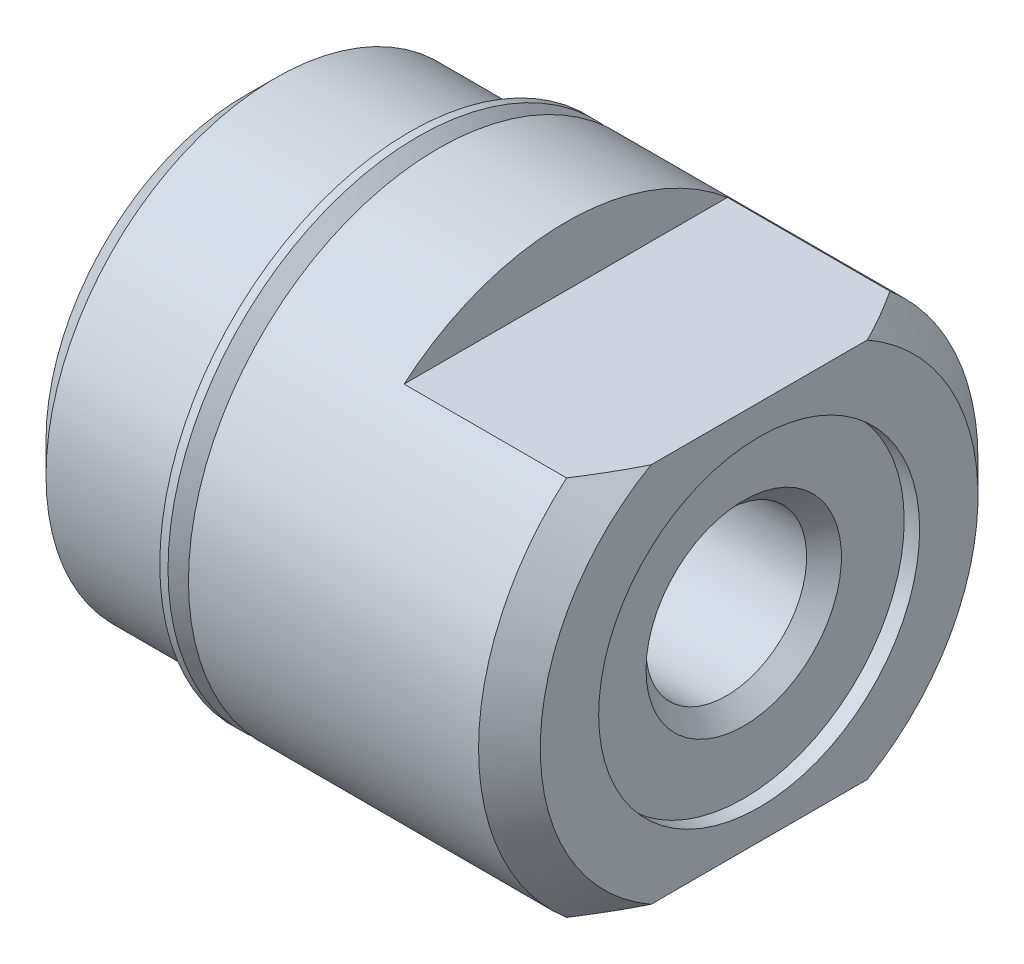
ISO-10303-21;
HEADER;
FILE_DESCRIPTION(('STEP AP214'),'2;1');
FILE_NAME('part.step','',(''),(''),'','','');
FILE_SCHEMA(('AUTOMOTIVE_DESIGN { 1 0 10303 214 1 1 1 1 }'));
ENDSEC;
DATA;
#1=APPLICATION_CONTEXT('core data for automotive mechanical design processes');
#2=APPLICATION_PROTOCOL_DEFINITION('international standard','automotive_design',2000,#1);
#3=PRODUCT_CONTEXT('',#1,'mechanical');
#4=PRODUCT('Part','Part','',(#3));
#5=PRODUCT_RELATED_PRODUCT_CATEGORY('part','',(#4));
#6=PRODUCT_DEFINITION_FORMATION('','',#4);
#7=PRODUCT_DEFINITION_CONTEXT('part definition',#1,'design');
#8=PRODUCT_DEFINITION('design','',#6,#7);
#9=PRODUCT_DEFINITION_SHAPE('','',#8);
#10=(LENGTH_UNIT() NAMED_UNIT(*) SI_UNIT(.MILLI.,.METRE.));
#11=(NAMED_UNIT(*) PLANE_ANGLE_UNIT() SI_UNIT($,.RADIAN.));
#12=(NAMED_UNIT(*) SI_UNIT($,.STERADIAN.) SOLID_ANGLE_UNIT());
#13=UNCERTAINTY_MEASURE_WITH_UNIT(LENGTH_MEASURE(1.E-05),#10,'distance_accuracy_value','');
#14=(GEOMETRIC_REPRESENTATION_CONTEXT(3) GLOBAL_UNCERTAINTY_ASSIGNED_CONTEXT((#13)) GLOBAL_UNIT_ASSIGNED_CONTEXT((#10,
#11,#12)) REPRESENTATION_CONTEXT('',''));
#15=CARTESIAN_POINT('',(0.,0.,0.));
#16=DIRECTION('',(0.,0.,1.));
#17=DIRECTION('',(1.,0.,0.));
#18=AXIS2_PLACEMENT_3D('',#15,#16,#17);
#19=CARTESIAN_POINT('',(12.7,0.,0.));
#20=DIRECTION('',(-1.,0.,0.));
#21=DIRECTION('',(0.,0.,1.));
#22=AXIS2_PLACEMENT_3D('',#19,#20,#21);
#23=CYLINDRICAL_SURFACE('',#22,5.16255);
#24=CARTESIAN_POINT('',(4.2672,0.,0.));
#25=DIRECTION('',(-1.,0.,0.));
#26=DIRECTION('',(0.,0.,1.));
#27=AXIS2_PLACEMENT_3D('',#24,#25,#26);
#28=CIRCLE('',#27,5.16255);
#29=CARTESIAN_POINT('',(4.2672,0.,5.16255));
#30=VERTEX_POINT('',#29);
#31=EDGE_CURVE('E119',#30,#30,#28,.T.);
#32=ORIENTED_EDGE('',*,*,#31,.F.);
#33=EDGE_LOOP('',(#32));
#34=FACE_BOUND('',#33,.T.);
#35=CARTESIAN_POINT('',(4.52120000000005,0.,0.));
#36=DIRECTION('',(1.,0.,0.));
#37=DIRECTION('',(0.,1.,0.));
#38=AXIS2_PLACEMENT_3D('',#35,#36,#37);
#39=CIRCLE('',#38,5.16255);
#40=CARTESIAN_POINT('',(4.52120000000003,5.16255000000003,0.));
#41=VERTEX_POINT('',#40);
#42=EDGE_CURVE('E11',#41,#41,#39,.T.);
#43=ORIENTED_EDGE('',*,*,#42,.F.);
#44=EDGE_LOOP('',(#43));
#45=FACE_BOUND('',#44,.T.);
#46=ADVANCED_FACE('F33',(#34,#45),#23,.T.);
#47=CARTESIAN_POINT('',(12.7,0.,0.));
#48=DIRECTION('',(-1.,0.,0.));
#49=DIRECTION('',(0.,0.,1.));
#50=AXIS2_PLACEMENT_3D('',#47,#48,#49);
#51=CYLINDRICAL_SURFACE('',#50,6.16585);
#52=CARTESIAN_POINT('',(4.7752,0.,0.));
#53=DIRECTION('',(-1.,0.,0.));
#54=DIRECTION('',(0.,0.,1.));
#55=AXIS2_PLACEMENT_3D('',#52,#53,#54);
#56=CIRCLE('',#55,6.16585);
#57=CARTESIAN_POINT('',(4.7752,0.,6.16585));
#58=VERTEX_POINT('',#57);
#59=EDGE_CURVE('E116',#58,#58,#56,.T.);
#60=ORIENTED_EDGE('',*,*,#59,.F.);
#61=EDGE_LOOP('',(#60));
#62=FACE_BOUND('',#61,.T.);
#63=DIRECTION('',(-1.,0.,0.));
#64=VECTOR('',#63,1.);
#65=CARTESIAN_POINT('',(12.7,4.699,-3.99213041150962));
#66=LINE('',#65,#64);
#67=CARTESIAN_POINT('',(11.938,4.699,-3.99213041150968));
#68=VERTEX_POINT('',#67);
#69=CARTESIAN_POINT('',(7.9248,4.699,-3.99213041150962));
#70=VERTEX_POINT('',#69);
#71=EDGE_CURVE('E146',#68,#70,#66,.T.);
#72=ORIENTED_EDGE('',*,*,#71,.F.);
#73=CARTESIAN_POINT('',(11.938,0.,0.));
#74=DIRECTION('',(-1.,0.,0.));
#75=DIRECTION('',(0.,0.,1.));
#76=AXIS2_PLACEMENT_3D('',#73,#74,#75);
#77=CIRCLE('',#76,6.16585);
#78=CARTESIAN_POINT('',(11.938,-4.699,-3.99213041150962));
#79=VERTEX_POINT('',#78);
#80=EDGE_CURVE('E115',#68,#79,#77,.T.);
#81=ORIENTED_EDGE('',*,*,#80,.T.);
#82=DIRECTION('',(-1.,0.,0.));
#83=VECTOR('',#82,1.);
#84=CARTESIAN_POINT('',(12.7,-4.699,-3.99213041150962));
#85=LINE('',#84,#83);
#86=CARTESIAN_POINT('',(7.9248,-4.699,-3.99213041150962));
#87=VERTEX_POINT('',#86);
#88=EDGE_CURVE('E255',#87,#79,#85,.F.);
#89=ORIENTED_EDGE('',*,*,#88,.F.);
#90=CARTESIAN_POINT('',(7.9248,0.,0.));
#91=DIRECTION('',(1.,0.,0.));
#92=DIRECTION('',(0.,0.,-1.));
#93=AXIS2_PLACEMENT_3D('',#90,#91,#92);
#94=CIRCLE('',#93,6.16585);
#95=CARTESIAN_POINT('',(7.9248,-4.699,3.99213041150962));
#96=VERTEX_POINT('',#95);
#97=EDGE_CURVE('E131',#96,#87,#94,.T.);
#98=ORIENTED_EDGE('',*,*,#97,.F.);
#99=DIRECTION('',(-1.,0.,0.));
#100=VECTOR('',#99,1.);
#101=CARTESIAN_POINT('',(12.7,-4.699,3.99213041150962));
#102=LINE('',#101,#100);
#103=CARTESIAN_POINT('',(11.938,-4.699,3.99213041150968));
#104=VERTEX_POINT('',#103);
#105=EDGE_CURVE('E102',#104,#96,#102,.T.);
#106=ORIENTED_EDGE('',*,*,#105,.F.);
#107=CARTESIAN_POINT('',(11.938,4.699,3.99213041150962));
#108=VERTEX_POINT('',#107);
#109=EDGE_CURVE('E101',#104,#108,#77,.T.);
#110=ORIENTED_EDGE('',*,*,#109,.T.);
#111=DIRECTION('',(-1.,0.,0.));
#112=VECTOR('',#111,1.);
#113=CARTESIAN_POINT('',(12.7,4.699,3.99213041150962));
#114=LINE('',#113,#112);
#115=CARTESIAN_POINT('',(7.9248,4.699,3.99213041150962));
#116=VERTEX_POINT('',#115);
#117=EDGE_CURVE('E145',#116,#108,#114,.F.);
#118=ORIENTED_EDGE('',*,*,#117,.F.);
#119=EDGE_CURVE('E132',#70,#116,#94,.T.);
#120=ORIENTED_EDGE('',*,*,#119,.F.);
#121=EDGE_LOOP('',(#72,#81,#89,#98,#106,#110,#118,#120));
#122=FACE_BOUND('',#121,.T.);
#123=ADVANCED_FACE('F149',(#62,#122),#51,.T.);
#124=CARTESIAN_POINT('',(12.7,0.,0.));
#125=DIRECTION('',(-1.,0.,0.));
#126=DIRECTION('',(0.,0.,1.));
#127=AXIS2_PLACEMENT_3D('',#124,#125,#126);
#128=CONICAL_SURFACE('',#127,5.40385,0.785398163397449);
#129=CARTESIAN_POINT('',(4.52466781445252,4.699,12.7402349989429));
#130=CARTESIAN_POINT('',(4.71101621171226,4.699,12.5416115809231));
#131=CARTESIAN_POINT('',(4.89709133598676,4.699,12.3427315775528));
#132=CARTESIAN_POINT('',(5.2686046869843,4.699,11.9443754370773));
#133=CARTESIAN_POINT('',(5.45404290986576,4.699,11.7448992963899));
#134=CARTESIAN_POINT('',(6.00949874127213,4.699,11.1452016582141));
#135=CARTESIAN_POINT('',(6.37842025035714,4.699,10.7439633783824));
#136=CARTESIAN_POINT('',(7.12071166476713,4.699,9.92864366358268));
#137=CARTESIAN_POINT('',(7.49398995426573,4.699,9.51447854171771));
#138=CARTESIAN_POINT('',(8.04935881112153,4.699,8.88938916935776));
#139=CARTESIAN_POINT('',(8.23367473963028,4.699,8.68044243745485));
#140=CARTESIAN_POINT('',(8.60049429675034,4.699,8.26096535522978));
#141=CARTESIAN_POINT('',(8.78299794110146,4.699,8.05043501868926));
#142=CARTESIAN_POINT('',(9.14570770291019,4.699,7.62755052369695));
#143=CARTESIAN_POINT('',(9.32591472554079,4.699,7.41519714270364));
#144=CARTESIAN_POINT('',(9.68355864522737,4.699,6.98815646648445));
#145=CARTESIAN_POINT('',(9.86099547027292,4.699,6.77346911083289));
#146=CARTESIAN_POINT('',(10.2126583676456,4.699,6.34083764395918));
#147=CARTESIAN_POINT('',(10.3868781550737,4.699,6.12288841101943));
#148=CARTESIAN_POINT('',(10.7307242329081,4.699,5.68340829620615));
#149=CARTESIAN_POINT('',(10.900350856804,4.699,5.46187767623679));
#150=CARTESIAN_POINT('',(11.2320441507543,4.699,5.01628093967176));
#151=CARTESIAN_POINT('',(11.3941648970263,4.699,4.79225526401358));
#152=CARTESIAN_POINT('',(11.7103952255393,4.699,4.33845504153772));
#153=CARTESIAN_POINT('',(11.8645019458442,4.699,4.10867848379472));
#154=CARTESIAN_POINT('',(12.161028629515,4.699,3.64263417569561));
#155=CARTESIAN_POINT('',(12.3034829165049,4.699,3.40638844370407));
#156=CARTESIAN_POINT('',(12.5724228495322,4.699,2.92505345368204));
#157=CARTESIAN_POINT('',(12.6989233558406,4.699,2.67997270289238));
#158=CARTESIAN_POINT('',(12.8802859182497,4.699,2.285042773868));
#159=CARTESIAN_POINT('',(12.9428263347575,4.699,2.13873129708755));
#160=CARTESIAN_POINT('',(13.0584368517118,4.699,1.84234248676626));
#161=CARTESIAN_POINT('',(13.1115055886493,4.699,1.69226461456992));
#162=CARTESIAN_POINT('',(13.2058610181686,4.699,1.38934074330098));
#163=CARTESIAN_POINT('',(13.2472131755532,4.699,1.2365154111473));
#164=CARTESIAN_POINT('',(13.3164864216429,4.699,0.927818152661953));
#165=CARTESIAN_POINT('',(13.3444090322784,4.699,0.771946573636778));
#166=CARTESIAN_POINT('',(13.3854251745301,4.699,0.455872813655211));
#167=CARTESIAN_POINT('',(13.3982928029052,4.699,0.295640687693381));
#168=CARTESIAN_POINT('',(13.4075194158134,4.699,-0.0252893357718128));
#169=CARTESIAN_POINT('',(13.4038802386189,4.699,-0.185987179418917));
#170=CARTESIAN_POINT('',(13.3803281870447,4.699,-0.50668143192206));
#171=CARTESIAN_POINT('',(13.3603631306269,4.699,-0.666673935355249));
#172=CARTESIAN_POINT('',(13.3054638357449,4.699,-0.98406438959813));
#173=CARTESIAN_POINT('',(13.270524853166,4.699,-1.14146150169666));
#174=CARTESIAN_POINT('',(13.1743091407152,4.699,-1.50306208676578));
#175=CARTESIAN_POINT('',(13.1081703404162,4.699,-1.70596107795612));
#176=CARTESIAN_POINT('',(12.9582085408533,4.699,-2.10507423934142));
#177=CARTESIAN_POINT('',(12.87437625981,4.699,-2.30128483789217));
#178=CARTESIAN_POINT('',(12.7380946492124,4.699,-2.59193748891912));
#179=CARTESIAN_POINT('',(12.6906063888528,4.699,-2.68875973907539));
#180=CARTESIAN_POINT('',(12.5926524399004,4.699,-2.88089113909931));
#181=CARTESIAN_POINT('',(12.5421867164441,4.699,-2.97620027123303));
#182=CARTESIAN_POINT('',(12.438701634254,4.699,-3.16537084771951));
#183=CARTESIAN_POINT('',(12.3856832149668,4.699,-3.25923280812461));
#184=CARTESIAN_POINT('',(12.2774137975546,4.699,-3.44565005023447));
#185=CARTESIAN_POINT('',(12.2221629122626,4.699,-3.53820539765967));
#186=CARTESIAN_POINT('',(12.0287255516503,4.699,-3.85463251605508));
#187=CARTESIAN_POINT('',(11.8857376627013,4.699,-4.07557492277119));
#188=CARTESIAN_POINT('',(11.5914289342603,4.699,-4.51186222176331));
#189=CARTESIAN_POINT('',(11.4401056393422,4.699,-4.72720543684419));
#190=CARTESIAN_POINT('',(11.13113453318,4.699,-5.15361601785852));
#191=CARTESIAN_POINT('',(10.9734805775267,4.699,-5.3646789150886));
#192=CARTESIAN_POINT('',(10.6535044714667,4.699,-5.78318386159783));
#193=CARTESIAN_POINT('',(10.4911828282336,4.699,-5.99062630035596));
#194=CARTESIAN_POINT('',(10.1622152335807,4.699,-6.4034813709064));
#195=CARTESIAN_POINT('',(9.99555390603567,4.699,-6.6088817193464));
#196=CARTESIAN_POINT('',(9.6593403735613,4.699,-7.01730531949099));
#197=CARTESIAN_POINT('',(9.48978810276276,4.699,-7.22032851685475));
#198=CARTESIAN_POINT('',(9.14846486450216,4.699,-7.62430233284187));
#199=CARTESIAN_POINT('',(8.97669520040647,4.699,-7.82525405435558));
#200=CARTESIAN_POINT('',(8.63127034786722,4.699,-8.22553152375789));
#201=CARTESIAN_POINT('',(8.4576151409889,4.699,-8.42485725571592));
#202=CARTESIAN_POINT('',(7.97540071304298,4.699,-8.97402502324132));
#203=CARTESIAN_POINT('',(7.66520764822484,4.699,-9.32243206305763));
#204=CARTESIAN_POINT('',(7.04126680547354,4.699,-10.0161381007297));
#205=CARTESIAN_POINT('',(6.72751847867242,4.699,-10.3614366035015));
#206=CARTESIAN_POINT('',(6.10001570196752,4.699,-11.0467335609293));
#207=CARTESIAN_POINT('',(5.78628325499937,4.699,-11.3867521890435));
#208=CARTESIAN_POINT('',(5.15683756411079,4.699,-12.0648268068244));
#209=CARTESIAN_POINT('',(4.84112472441274,4.699,-12.4028831715247));
#210=CARTESIAN_POINT('',(4.52466781445252,4.699,-12.7402349989429));
#211=B_SPLINE_CURVE_WITH_KNOTS('',3,(#129,#130,#131,#132,#133,#134,#135,#136,#137,#138,#139,
#140,#141,#142,#143,#144,#145,#146,#147,#148,#149,#150,#151,#152,#153,#154,#155,#156,#157,#158,
#159,#160,#161,#162,#163,#164,#165,#166,#167,#168,#169,#170,#171,#172,#173,#174,#175,#176,#177,
#178,#179,#180,#181,#182,#183,#184,#185,#186,#187,#188,#189,#190,#191,#192,#193,#194,#195,#196,
#197,#198,#199,#200,#201,#202,#203,#204,#205,#206,#207,#208,#209,#210),.UNSPECIFIED.,.F.,.F.,(4,
2,2,2,2,2,2,2,2,2,2,2,2,2,2,2,2,2,2,2,2,2,2,2,2,2,2,2,2,2,2,2,2,2,2,2,2,2,2,2,4),(0.,
0.817063397130031,1.63413171388548,3.26930762463296,4.94193142436759,5.77779413925872,
6.61364958827339,7.44916472311893,8.28470154087651,9.12172725976529,9.95869204201199,
10.7881655921263,11.617933354411,12.4451616302559,13.2716135959568,13.7487079811293,
14.2258709917944,14.7003128347684,15.1747008979891,15.6561195007785,16.1374844919343,
16.6203941009716,17.1034568211027,17.7425651112888,18.3820095067559,18.7054919073447,
19.0289780963927,19.3523461322686,19.6756978449035,20.464920356173,21.2543766113314,
22.0446185497025,22.8347749453909,23.6282706793956,24.4217845171623,25.2148514428648,
26.0079261293043,27.4073410786192,28.8069750981651,30.1949017827737,31.5825538392095),.UNSPECIFIED.);
#212=CARTESIAN_POINT('',(12.7,4.699,2.66851903169155));
#213=VERTEX_POINT('',#212);
#214=EDGE_CURVE('E56',#108,#213,#211,.T.);
#215=ORIENTED_EDGE('',*,*,#214,.F.);
#216=ORIENTED_EDGE('',*,*,#109,.F.);
#217=CARTESIAN_POINT('',(4.52466781445252,-4.699,-12.7402349989429));
#218=CARTESIAN_POINT('',(4.71101621171226,-4.699,-12.5416115809231));
#219=CARTESIAN_POINT('',(4.89709133598676,-4.699,-12.3427315775528));
#220=CARTESIAN_POINT('',(5.2686046869843,-4.699,-11.9443754370773));
#221=CARTESIAN_POINT('',(5.45404290986576,-4.699,-11.7448992963899));
#222=CARTESIAN_POINT('',(6.00949874127213,-4.699,-11.1452016582141));
#223=CARTESIAN_POINT('',(6.37842025035714,-4.699,-10.7439633783824));
#224=CARTESIAN_POINT('',(7.12071166476713,-4.699,-9.92864366358268));
#225=CARTESIAN_POINT('',(7.49398995426573,-4.699,-9.51447854171771));
#226=CARTESIAN_POINT('',(8.04935881112153,-4.699,-8.88938916935776));
#227=CARTESIAN_POINT('',(8.23367473963028,-4.699,-8.68044243745485));
#228=CARTESIAN_POINT('',(8.60049429675034,-4.699,-8.26096535522978));
#229=CARTESIAN_POINT('',(8.78299794110146,-4.699,-8.05043501868926));
#230=CARTESIAN_POINT('',(9.14570770291019,-4.699,-7.62755052369695));
#231=CARTESIAN_POINT('',(9.32591472554079,-4.699,-7.41519714270364));
#232=CARTESIAN_POINT('',(9.68355864522737,-4.699,-6.98815646648445));
#233=CARTESIAN_POINT('',(9.86099547027292,-4.699,-6.77346911083289));
#234=CARTESIAN_POINT('',(10.2126583676456,-4.699,-6.34083764395918));
#235=CARTESIAN_POINT('',(10.3868781550737,-4.699,-6.12288841101943));
#236=CARTESIAN_POINT('',(10.7307242329081,-4.699,-5.68340829620615));
#237=CARTESIAN_POINT('',(10.900350856804,-4.699,-5.46187767623679));
#238=CARTESIAN_POINT('',(11.2320441507543,-4.699,-5.01628093967176));
#239=CARTESIAN_POINT('',(11.3941648970263,-4.699,-4.79225526401358));
#240=CARTESIAN_POINT('',(11.7103952255393,-4.699,-4.33845504153772));
#241=CARTESIAN_POINT('',(11.8645019458442,-4.699,-4.10867848379472));
#242=CARTESIAN_POINT('',(12.161028629515,-4.699,-3.64263417569561));
#243=CARTESIAN_POINT('',(12.3034829165049,-4.699,-3.40638844370407));
#244=CARTESIAN_POINT('',(12.5724228495322,-4.699,-2.92505345368204));
#245=CARTESIAN_POINT('',(12.6989233558406,-4.699,-2.67997270289238));
#246=CARTESIAN_POINT('',(12.8802859182497,-4.699,-2.285042773868));
#247=CARTESIAN_POINT('',(12.9428263347575,-4.699,-2.13873129708755));
#248=CARTESIAN_POINT('',(13.0584368517118,-4.699,-1.84234248676626));
#249=CARTESIAN_POINT('',(13.1115055886493,-4.699,-1.69226461456992));
#250=CARTESIAN_POINT('',(13.2058610181686,-4.699,-1.38934074330098));
#251=CARTESIAN_POINT('',(13.2472131755532,-4.699,-1.2365154111473));
#252=CARTESIAN_POINT('',(13.3164864216429,-4.699,-0.927818152661953));
#253=CARTESIAN_POINT('',(13.3444090322784,-4.699,-0.771946573636778));
#254=CARTESIAN_POINT('',(13.3854251745301,-4.699,-0.455872813655211));
#255=CARTESIAN_POINT('',(13.3982928029052,-4.699,-0.295640687693381));
#256=CARTESIAN_POINT('',(13.4075194158134,-4.699,0.0252893357718128));
#257=CARTESIAN_POINT('',(13.4038802386189,-4.699,0.185987179418917));
#258=CARTESIAN_POINT('',(13.3803281870447,-4.699,0.50668143192206));
#259=CARTESIAN_POINT('',(13.3603631306269,-4.699,0.666673935355249));
#260=CARTESIAN_POINT('',(13.3054638357449,-4.699,0.98406438959813));
#261=CARTESIAN_POINT('',(13.270524853166,-4.699,1.14146150169666));
#262=CARTESIAN_POINT('',(13.1743091407152,-4.699,1.50306208676578));
#263=CARTESIAN_POINT('',(13.1081703404162,-4.699,1.70596107795612));
#264=CARTESIAN_POINT('',(12.9582085408533,-4.699,2.10507423934142));
#265=CARTESIAN_POINT('',(12.87437625981,-4.699,2.30128483789217));
#266=CARTESIAN_POINT('',(12.7380946492124,-4.699,2.59193748891912));
#267=CARTESIAN_POINT('',(12.6906063888528,-4.699,2.68875973907539));
#268=CARTESIAN_POINT('',(12.5926524399004,-4.699,2.88089113909931));
#269=CARTESIAN_POINT('',(12.5421867164441,-4.699,2.97620027123303));
#270=CARTESIAN_POINT('',(12.438701634254,-4.699,3.16537084771951));
#271=CARTESIAN_POINT('',(12.3856832149668,-4.699,3.25923280812461));
#272=CARTESIAN_POINT('',(12.2774137975546,-4.699,3.44565005023447));
#273=CARTESIAN_POINT('',(12.2221629122626,-4.699,3.53820539765967));
#274=CARTESIAN_POINT('',(12.0287255516503,-4.699,3.85463251605508));
#275=CARTESIAN_POINT('',(11.8857376627013,-4.699,4.07557492277119));
#276=CARTESIAN_POINT('',(11.5914289342603,-4.699,4.51186222176331));
#277=CARTESIAN_POINT('',(11.4401056393422,-4.699,4.72720543684419));
#278=CARTESIAN_POINT('',(11.13113453318,-4.699,5.15361601785852));
#279=CARTESIAN_POINT('',(10.9734805775267,-4.699,5.3646789150886));
#280=CARTESIAN_POINT('',(10.6535044714667,-4.699,5.78318386159783));
#281=CARTESIAN_POINT('',(10.4911828282336,-4.699,5.99062630035596));
#282=CARTESIAN_POINT('',(10.1622152335807,-4.699,6.4034813709064));
#283=CARTESIAN_POINT('',(9.99555390603567,-4.699,6.6088817193464));
#284=CARTESIAN_POINT('',(9.6593403735613,-4.699,7.01730531949099));
#285=CARTESIAN_POINT('',(9.48978810276276,-4.699,7.22032851685475));
#286=CARTESIAN_POINT('',(9.14846486450216,-4.699,7.62430233284187));
#287=CARTESIAN_POINT('',(8.97669520040647,-4.699,7.82525405435558));
#288=CARTESIAN_POINT('',(8.63127034786722,-4.699,8.22553152375789));
#289=CARTESIAN_POINT('',(8.4576151409889,-4.699,8.42485725571592));
#290=CARTESIAN_POINT('',(7.97540071304298,-4.699,8.97402502324132));
#291=CARTESIAN_POINT('',(7.66520764822484,-4.699,9.32243206305763));
#292=CARTESIAN_POINT('',(7.04126680547354,-4.699,10.0161381007297));
#293=CARTESIAN_POINT('',(6.72751847867242,-4.699,10.3614366035015));
#294=CARTESIAN_POINT('',(6.10001570196752,-4.699,11.0467335609293));
#295=CARTESIAN_POINT('',(5.78628325499937,-4.699,11.3867521890435));
#296=CARTESIAN_POINT('',(5.15683756411079,-4.699,12.0648268068244));
#297=CARTESIAN_POINT('',(4.84112472441274,-4.699,12.4028831715247));
#298=CARTESIAN_POINT('',(4.52466781445252,-4.699,12.7402349989429));
#299=B_SPLINE_CURVE_WITH_KNOTS('',3,(#217,#218,#219,#220,#221,#222,#223,#224,#225,#226,#227,
#228,#229,#230,#231,#232,#233,#234,#235,#236,#237,#238,#239,#240,#241,#242,#243,#244,#245,#246,
#247,#248,#249,#250,#251,#252,#253,#254,#255,#256,#257,#258,#259,#260,#261,#262,#263,#264,#265,
#266,#267,#268,#269,#270,#271,#272,#273,#274,#275,#276,#277,#278,#279,#280,#281,#282,#283,#284,
#285,#286,#287,#288,#289,#290,#291,#292,#293,#294,#295,#296,#297,#298),.UNSPECIFIED.,.F.,.F.,(4,
2,2,2,2,2,2,2,2,2,2,2,2,2,2,2,2,2,2,2,2,2,2,2,2,2,2,2,2,2,2,2,2,2,2,2,2,2,2,2,4),(0.,
0.817063397130031,1.63413171388548,3.26930762463296,4.94193142436759,5.77779413925872,
6.61364958827339,7.44916472311893,8.28470154087651,9.12172725976529,9.95869204201199,
10.7881655921263,11.617933354411,12.4451616302559,13.2716135959568,13.7487079811293,
14.2258709917944,14.7003128347684,15.1747008979891,15.6561195007785,16.1374844919343,
16.6203941009716,17.1034568211027,17.7425651112888,18.3820095067559,18.7054919073447,
19.0289780963927,19.3523461322686,19.6756978449035,20.464920356173,21.2543766113314,
22.0446185497025,22.8347749453909,23.6282706793956,24.4217845171623,25.2148514428648,
26.0079261293043,27.4073410786192,28.8069750981651,30.1949017827737,31.5825538392095),.UNSPECIFIED.);
#300=CARTESIAN_POINT('',(12.7,-4.699,2.66851903169155));
#301=VERTEX_POINT('',#300);
#302=EDGE_CURVE('E86',#301,#104,#299,.T.);
#303=ORIENTED_EDGE('',*,*,#302,.F.);
#304=CARTESIAN_POINT('',(12.7,0.,0.));
#305=DIRECTION('',(-1.,0.,0.));
#306=DIRECTION('',(0.,0.,1.));
#307=AXIS2_PLACEMENT_3D('',#304,#305,#306);
#308=CIRCLE('',#307,5.40385);
#309=EDGE_CURVE('E99',#301,#213,#308,.T.);
#310=ORIENTED_EDGE('',*,*,#309,.T.);
#311=EDGE_LOOP('',(#215,#216,#303,#310));
#312=FACE_BOUND('',#311,.T.);
#313=ADVANCED_FACE('F98',(#312),#128,.T.);
#314=CARTESIAN_POINT('',(12.7,4.699,-2.66851903169155));
#315=VERTEX_POINT('',#314);
#316=EDGE_CURVE('E156',#315,#68,#211,.T.);
#317=ORIENTED_EDGE('',*,*,#316,.F.);
#318=CARTESIAN_POINT('',(12.7,-4.699,-2.66851903169155));
#319=VERTEX_POINT('',#318);
#320=EDGE_CURVE('E106',#315,#319,#308,.T.);
#321=ORIENTED_EDGE('',*,*,#320,.T.);
#322=EDGE_CURVE('E48',#79,#319,#299,.T.);
#323=ORIENTED_EDGE('',*,*,#322,.F.);
#324=ORIENTED_EDGE('',*,*,#80,.F.);
#325=EDGE_LOOP('',(#317,#321,#323,#324));
#326=FACE_BOUND('',#325,.T.);
#327=ADVANCED_FACE('F219',(#326),#128,.T.);
#328=CARTESIAN_POINT('',(12.7,5.40385,0.));
#329=DIRECTION('',(-1.,0.,0.));
#330=DIRECTION('',(0.,0.,1.));
#331=AXIS2_PLACEMENT_3D('',#328,#329,#330);
#332=PLANE('',#331);
#333=CARTESIAN_POINT('',(12.7,0.,0.));
#334=DIRECTION('',(-1.,0.,0.));
#335=DIRECTION('',(0.,0.,1.));
#336=AXIS2_PLACEMENT_3D('',#333,#334,#335);
#337=CIRCLE('',#336,3.9624);
#338=CARTESIAN_POINT('',(12.7,0.,3.9624));
#339=VERTEX_POINT('',#338);
#340=EDGE_CURVE('E110',#339,#339,#337,.T.);
#341=ORIENTED_EDGE('',*,*,#340,.T.);
#342=EDGE_LOOP('',(#341));
#343=FACE_BOUND('',#342,.T.);
#344=DIRECTION('',(0.,0.,-1.));
#345=VECTOR('',#344,1.);
#346=CARTESIAN_POINT('',(12.7,4.699,0.));
#347=LINE('',#346,#345);
#348=EDGE_CURVE('E92',#213,#315,#347,.T.);
#349=ORIENTED_EDGE('',*,*,#348,.F.);
#350=ORIENTED_EDGE('',*,*,#309,.F.);
#351=DIRECTION('',(0.,0.,1.));
#352=VECTOR('',#351,1.);
#353=CARTESIAN_POINT('',(12.7,-4.699,0.));
#354=LINE('',#353,#352);
#355=EDGE_CURVE('E83',#319,#301,#354,.T.);
#356=ORIENTED_EDGE('',*,*,#355,.F.);
#357=ORIENTED_EDGE('',*,*,#320,.F.);
#358=EDGE_LOOP('',(#349,#350,#356,#357));
#359=FACE_BOUND('',#358,.T.);
#360=ADVANCED_FACE('F105',(#343,#359),#332,.F.);
#361=CARTESIAN_POINT('',(0.,0.,0.));
#362=DIRECTION('',(1.,0.,0.));
#363=DIRECTION('',(0.,0.,-1.));
#364=AXIS2_PLACEMENT_3D('',#361,#362,#363);
#365=PLANE('',#364);
#366=CARTESIAN_POINT('',(0.,0.,0.));
#367=DIRECTION('',(-1.,0.,0.));
#368=DIRECTION('',(0.,0.,1.));
#369=AXIS2_PLACEMENT_3D('',#366,#367,#368);
#370=CIRCLE('',#369,1.98374);
#371=CARTESIAN_POINT('',(0.,0.,1.98374));
#372=VERTEX_POINT('',#371);
#373=EDGE_CURVE('E161',#372,#372,#370,.T.);
#374=ORIENTED_EDGE('',*,*,#373,.F.);
#375=EDGE_LOOP('',(#374));
#376=FACE_BOUND('',#375,.T.);
#377=CARTESIAN_POINT('',(0.,0.,0.));
#378=DIRECTION('',(-1.,0.,0.));
#379=DIRECTION('',(0.,0.,1.));
#380=AXIS2_PLACEMENT_3D('',#377,#378,#379);
#381=CIRCLE('',#380,4.90855);
#382=CARTESIAN_POINT('',(0.,0.,4.90855));
#383=VERTEX_POINT('',#382);
#384=EDGE_CURVE('E93',#383,#383,#381,.T.);
#385=ORIENTED_EDGE('',*,*,#384,.T.);
#386=EDGE_LOOP('',(#385));
#387=FACE_BOUND('',#386,.T.);
#388=ADVANCED_FACE('F35',(#376,#387),#365,.F.);
#389=CARTESIAN_POINT('',(0.762000000000001,0.,0.));
#390=DIRECTION('',(1.,0.,0.));
#391=DIRECTION('',(0.,0.,-1.));
#392=AXIS2_PLACEMENT_3D('',#389,#390,#391);
#393=CONICAL_SURFACE('',#392,5.67055,0.785398163397448);
#394=ORIENTED_EDGE('',*,*,#384,.F.);
#395=EDGE_LOOP('',(#394));
#396=FACE_BOUND('',#395,.T.);
#397=CARTESIAN_POINT('',(0.762000000000001,0.,0.));
#398=DIRECTION('',(-1.,0.,0.));
#399=DIRECTION('',(0.,0.,1.));
#400=AXIS2_PLACEMENT_3D('',#397,#398,#399);
#401=CIRCLE('',#400,5.67055);
#402=CARTESIAN_POINT('',(0.762000000000001,0.,5.67055));
#403=VERTEX_POINT('',#402);
#404=EDGE_CURVE('E125',#403,#403,#401,.T.);
#405=ORIENTED_EDGE('',*,*,#404,.T.);
#406=EDGE_LOOP('',(#405));
#407=FACE_BOUND('',#406,.T.);
#408=ADVANCED_FACE('F201',(#396,#407),#393,.T.);
#409=CARTESIAN_POINT('',(12.7,0.,0.));
#410=DIRECTION('',(-1.,0.,0.));
#411=DIRECTION('',(0.,0.,1.));
#412=AXIS2_PLACEMENT_3D('',#409,#410,#411);
#413=CYLINDRICAL_SURFACE('',#412,5.67055);
#414=ORIENTED_EDGE('',*,*,#404,.F.);
#415=EDGE_LOOP('',(#414));
#416=FACE_BOUND('',#415,.T.);
#417=CARTESIAN_POINT('',(3.7592,0.,0.));
#418=DIRECTION('',(-1.,0.,0.));
#419=DIRECTION('',(0.,0.,1.));
#420=AXIS2_PLACEMENT_3D('',#417,#418,#419);
#421=CIRCLE('',#420,5.67055);
#422=CARTESIAN_POINT('',(3.7592,0.,5.67055));
#423=VERTEX_POINT('',#422);
#424=EDGE_CURVE('E122',#423,#423,#421,.T.);
#425=ORIENTED_EDGE('',*,*,#424,.T.);
#426=EDGE_LOOP('',(#425));
#427=FACE_BOUND('',#426,.T.);
#428=ADVANCED_FACE('F198',(#416,#427),#413,.T.);
#429=CARTESIAN_POINT('',(4.2672,0.,0.));
#430=DIRECTION('',(-1.,0.,0.));
#431=DIRECTION('',(0.,0.,1.));
#432=AXIS2_PLACEMENT_3D('',#429,#430,#431);
#433=CONICAL_SURFACE('',#432,5.16255,0.78539816339745);
#434=ORIENTED_EDGE('',*,*,#424,.F.);
#435=EDGE_LOOP('',(#434));
#436=FACE_BOUND('',#435,.T.);
#437=ORIENTED_EDGE('',*,*,#31,.T.);
#438=EDGE_LOOP('',(#437));
#439=FACE_BOUND('',#438,.T.);
#440=ADVANCED_FACE('F195',(#436,#439),#433,.T.);
#441=CARTESIAN_POINT('',(4.7752,5.16255,0.));
#442=DIRECTION('',(1.,0.,0.));
#443=DIRECTION('',(0.,0.,-1.));
#444=AXIS2_PLACEMENT_3D('',#441,#442,#443);
#445=PLANE('',#444);
#446=CARTESIAN_POINT('',(4.7752,0.,0.));
#447=DIRECTION('',(1.,0.,0.));
#448=DIRECTION('',(0.,0.,-1.));
#449=AXIS2_PLACEMENT_3D('',#446,#447,#448);
#450=CIRCLE('',#449,5.6603386855597);
#451=CARTESIAN_POINT('',(4.7752,0.,-5.66033868555973));
#452=VERTEX_POINT('',#451);
#453=EDGE_CURVE('E41',#452,#452,#450,.F.);
#454=ORIENTED_EDGE('',*,*,#453,.F.);
#455=EDGE_LOOP('',(#454));
#456=FACE_BOUND('',#455,.T.);
#457=ORIENTED_EDGE('',*,*,#59,.T.);
#458=EDGE_LOOP('',(#457));
#459=FACE_BOUND('',#458,.T.);
#460=ADVANCED_FACE('F180',(#456,#459),#445,.F.);
#461=CARTESIAN_POINT('',(12.319,0.,0.));
#462=DIRECTION('',(1.,0.,0.));
#463=DIRECTION('',(0.,0.,-1.));
#464=AXIS2_PLACEMENT_3D('',#461,#462,#463);
#465=PLANE('',#464);
#466=CARTESIAN_POINT('',(12.319,0.,0.));
#467=DIRECTION('',(-1.,0.,0.));
#468=DIRECTION('',(0.,0.,1.));
#469=AXIS2_PLACEMENT_3D('',#466,#467,#468);
#470=CIRCLE('',#469,2.413);
#471=CARTESIAN_POINT('',(12.319,0.,2.413));
#472=VERTEX_POINT('',#471);
#473=EDGE_CURVE('E150',#472,#472,#470,.T.);
#474=ORIENTED_EDGE('',*,*,#473,.T.);
#475=EDGE_LOOP('',(#474));
#476=FACE_BOUND('',#475,.T.);
#477=CARTESIAN_POINT('',(12.319,0.,0.));
#478=DIRECTION('',(-1.,0.,0.));
#479=DIRECTION('',(0.,0.,1.));
#480=AXIS2_PLACEMENT_3D('',#477,#478,#479);
#481=CIRCLE('',#480,3.9624);
#482=CARTESIAN_POINT('',(12.319,0.,3.9624));
#483=VERTEX_POINT('',#482);
#484=EDGE_CURVE('E107',#483,#483,#481,.T.);
#485=ORIENTED_EDGE('',*,*,#484,.F.);
#486=EDGE_LOOP('',(#485));
#487=FACE_BOUND('',#486,.T.);
#488=ADVANCED_FACE('F170',(#476,#487),#465,.T.);
#489=CARTESIAN_POINT('',(12.7,0.,0.));
#490=DIRECTION('',(-1.,0.,0.));
#491=DIRECTION('',(0.,0.,1.));
#492=AXIS2_PLACEMENT_3D('',#489,#490,#491);
#493=CYLINDRICAL_SURFACE('',#492,3.9624);
#494=ORIENTED_EDGE('',*,*,#484,.T.);
#495=EDGE_LOOP('',(#494));
#496=FACE_BOUND('',#495,.T.);
#497=ORIENTED_EDGE('',*,*,#340,.F.);
#498=EDGE_LOOP('',(#497));
#499=FACE_BOUND('',#498,.T.);
#500=ADVANCED_FACE('F167',(#496,#499),#493,.F.);
#501=CARTESIAN_POINT('',(12.319,0.,0.));
#502=DIRECTION('',(-1.,0.,0.));
#503=DIRECTION('',(0.,0.,1.));
#504=AXIS2_PLACEMENT_3D('',#501,#502,#503);
#505=CYLINDRICAL_SURFACE('',#504,1.98374);
#506=ORIENTED_EDGE('',*,*,#373,.T.);
#507=EDGE_LOOP('',(#506));
#508=FACE_BOUND('',#507,.T.);
#509=CARTESIAN_POINT('',(11.88974,0.,0.));
#510=DIRECTION('',(-1.,0.,0.));
#511=DIRECTION('',(0.,0.,1.));
#512=AXIS2_PLACEMENT_3D('',#509,#510,#511);
#513=CIRCLE('',#512,1.98374);
#514=CARTESIAN_POINT('',(11.88974,0.,1.98374));
#515=VERTEX_POINT('',#514);
#516=EDGE_CURVE('E153',#515,#515,#513,.T.);
#517=ORIENTED_EDGE('',*,*,#516,.F.);
#518=EDGE_LOOP('',(#517));
#519=FACE_BOUND('',#518,.T.);
#520=ADVANCED_FACE('F169',(#508,#519),#505,.F.);
#521=CARTESIAN_POINT('',(12.319,0.,0.));
#522=DIRECTION('',(1.,0.,0.));
#523=DIRECTION('',(0.,0.,-1.));
#524=AXIS2_PLACEMENT_3D('',#521,#522,#523);
#525=CONICAL_SURFACE('',#524,2.413,0.785398163397448);
#526=ORIENTED_EDGE('',*,*,#516,.T.);
#527=EDGE_LOOP('',(#526));
#528=FACE_BOUND('',#527,.T.);
#529=ORIENTED_EDGE('',*,*,#473,.F.);
#530=EDGE_LOOP('',(#529));
#531=FACE_BOUND('',#530,.T.);
#532=ADVANCED_FACE('F177',(#528,#531),#525,.F.);
#533=CARTESIAN_POINT('',(7.9248,-4.699,12.3317));
#534=DIRECTION('',(0.,-1.,0.));
#535=DIRECTION('',(0.,0.,-1.));
#536=AXIS2_PLACEMENT_3D('',#533,#534,#535);
#537=PLANE('',#536);
#538=ORIENTED_EDGE('',*,*,#88,.T.);
#539=ORIENTED_EDGE('',*,*,#322,.T.);
#540=ORIENTED_EDGE('',*,*,#355,.T.);
#541=ORIENTED_EDGE('',*,*,#302,.T.);
#542=ORIENTED_EDGE('',*,*,#105,.T.);
#543=DIRECTION('',(0.,0.,-1.));
#544=VECTOR('',#543,1.);
#545=CARTESIAN_POINT('',(7.9248,-4.699,12.3317));
#546=LINE('',#545,#544);
#547=EDGE_CURVE('E147',#96,#87,#546,.T.);
#548=ORIENTED_EDGE('',*,*,#547,.T.);
#549=EDGE_LOOP('',(#538,#539,#540,#541,#542,#548));
#550=FACE_BOUND('',#549,.T.);
#551=ADVANCED_FACE('F85',(#550),#537,.T.);
#552=CARTESIAN_POINT('',(7.9248,0.,0.));
#553=DIRECTION('',(1.,0.,0.));
#554=DIRECTION('',(0.,0.,-1.));
#555=AXIS2_PLACEMENT_3D('',#552,#553,#554);
#556=PLANE('',#555);
#557=ORIENTED_EDGE('',*,*,#97,.T.);
#558=ORIENTED_EDGE('',*,*,#547,.F.);
#559=EDGE_LOOP('',(#557,#558));
#560=FACE_BOUND('',#559,.T.);
#561=ADVANCED_FACE('F234',(#560),#556,.T.);
#562=ORIENTED_EDGE('',*,*,#119,.T.);
#563=DIRECTION('',(0.,0.,1.));
#564=VECTOR('',#563,1.);
#565=CARTESIAN_POINT('',(7.9248,4.699,-12.3317));
#566=LINE('',#565,#564);
#567=EDGE_CURVE('E103',#70,#116,#566,.T.);
#568=ORIENTED_EDGE('',*,*,#567,.F.);
#569=EDGE_LOOP('',(#562,#568));
#570=FACE_BOUND('',#569,.T.);
#571=ADVANCED_FACE('F140',(#570),#556,.T.);
#572=CARTESIAN_POINT('',(7.9248,4.699,-12.3317));
#573=DIRECTION('',(0.,1.,0.));
#574=DIRECTION('',(0.,0.,1.));
#575=AXIS2_PLACEMENT_3D('',#572,#573,#574);
#576=PLANE('',#575);
#577=ORIENTED_EDGE('',*,*,#117,.T.);
#578=ORIENTED_EDGE('',*,*,#214,.T.);
#579=ORIENTED_EDGE('',*,*,#348,.T.);
#580=ORIENTED_EDGE('',*,*,#316,.T.);
#581=ORIENTED_EDGE('',*,*,#71,.T.);
#582=ORIENTED_EDGE('',*,*,#567,.T.);
#583=EDGE_LOOP('',(#577,#578,#579,#580,#581,#582));
#584=FACE_BOUND('',#583,.T.);
#585=ADVANCED_FACE('F144',(#584),#576,.T.);
#586=CARTESIAN_POINT('',(4.7752,0.,0.));
#587=DIRECTION('',(-1.,0.,0.));
#588=DIRECTION('',(0.,-1.,0.));
#589=AXIS2_PLACEMENT_3D('',#586,#587,#588);
#590=CYLINDRICAL_SURFACE('',#589,6.16584999999998);
#591=CARTESIAN_POINT('',(4.06648868555973,0.,0.));
#592=DIRECTION('',(-1.,0.,0.));
#593=DIRECTION('',(0.,-1.,0.));
#594=AXIS2_PLACEMENT_3D('',#591,#592,#593);
#595=CIRCLE('',#594,6.16584999999998);
#596=CARTESIAN_POINT('',(4.06648868555977,-6.16584999999995,0.));
#597=VERTEX_POINT('',#596);
#598=EDGE_CURVE('E386',#597,#597,#595,.T.);
#599=ORIENTED_EDGE('',*,*,#598,.F.);
#600=EDGE_LOOP('',(#599));
#601=FACE_BOUND('',#600,.T.);
#602=CARTESIAN_POINT('',(4.26968868555973,0.,0.));
#603=DIRECTION('',(-1.,0.,0.));
#604=DIRECTION('',(0.,-1.,0.));
#605=AXIS2_PLACEMENT_3D('',#602,#603,#604);
#606=CIRCLE('',#605,6.16584999999997);
#607=CARTESIAN_POINT('',(4.26968868555977,-6.16584999999995,0.));
#608=VERTEX_POINT('',#607);
#609=EDGE_CURVE('E261',#608,#608,#606,.T.);
#610=ORIENTED_EDGE('',*,*,#609,.T.);
#611=EDGE_LOOP('',(#610));
#612=FACE_BOUND('',#611,.T.);
#613=ADVANCED_FACE('F304',(#601,#612),#590,.T.);
#614=CARTESIAN_POINT('',(4.77520000000003,0.,0.));
#615=DIRECTION('',(-1.,0.,0.));
#616=DIRECTION('',(0.,-1.,0.));
#617=AXIS2_PLACEMENT_3D('',#614,#615,#616);
#618=CONICAL_SURFACE('',#617,5.66033868555967,0.785398163397453);
#619=ORIENTED_EDGE('',*,*,#609,.F.);
#620=EDGE_LOOP('',(#619));
#621=FACE_BOUND('',#620,.T.);
#622=ORIENTED_EDGE('',*,*,#453,.T.);
#623=EDGE_LOOP('',(#622));
#624=FACE_BOUND('',#623,.T.);
#625=ADVANCED_FACE('F327',(#621,#624),#618,.T.);
#626=CARTESIAN_POINT('',(4.66360768363213,0.,0.));
#627=DIRECTION('',(1.,0.,0.));
#628=DIRECTION('',(0.,1.,0.));
#629=AXIS2_PLACEMENT_3D('',#626,#627,#628);
#630=CONICAL_SURFACE('',#629,5.30495768363207,0.785398163397442);
#631=ORIENTED_EDGE('',*,*,#42,.T.);
#632=EDGE_LOOP('',(#631));
#633=FACE_BOUND('',#632,.T.);
#634=CARTESIAN_POINT('',(4.66360768363213,0.,0.));
#635=DIRECTION('',(-1.,0.,0.));
#636=DIRECTION('',(0.,-1.,0.));
#637=AXIS2_PLACEMENT_3D('',#634,#635,#636);
#638=CIRCLE('',#637,5.30495768363207);
#639=CARTESIAN_POINT('',(4.66360768363216,-5.30495768363205,0.));
#640=VERTEX_POINT('',#639);
#641=EDGE_CURVE('E393',#640,#640,#638,.T.);
#642=ORIENTED_EDGE('',*,*,#641,.T.);
#643=EDGE_LOOP('',(#642));
#644=FACE_BOUND('',#643,.T.);
#645=ADVANCED_FACE('F336',(#633,#644),#630,.T.);
#646=CARTESIAN_POINT('',(4.57380512242139,0.,0.));
#647=DIRECTION('',(-1.,0.,0.));
#648=DIRECTION('',(0.,-1.,0.));
#649=AXIS2_PLACEMENT_3D('',#646,#647,#648);
#650=TOROIDAL_SURFACE('',#649,5.39476024484277,0.127000000000042);
#651=ORIENTED_EDGE('',*,*,#641,.F.);
#652=EDGE_LOOP('',(#651));
#653=FACE_BOUND('',#652,.T.);
#654=CARTESIAN_POINT('',(4.66360768363213,0.,0.));
#655=DIRECTION('',(-1.,0.,0.));
#656=DIRECTION('',(0.,-1.,0.));
#657=AXIS2_PLACEMENT_3D('',#654,#655,#656);
#658=CIRCLE('',#657,5.48456280605347);
#659=CARTESIAN_POINT('',(4.66360768363216,-5.48456280605345,0.));
#660=VERTEX_POINT('',#659);
#661=EDGE_CURVE('E388',#660,#660,#658,.T.);
#662=ORIENTED_EDGE('',*,*,#661,.T.);
#663=EDGE_LOOP('',(#662));
#664=FACE_BOUND('',#663,.T.);
#665=ADVANCED_FACE('F346',(#653,#664),#650,.F.);
#666=CARTESIAN_POINT('',(4.06648868555973,0.,0.));
#667=DIRECTION('',(-1.,0.,0.));
#668=DIRECTION('',(0.,-1.,0.));
#669=AXIS2_PLACEMENT_3D('',#666,#667,#668);
#670=CONICAL_SURFACE('',#669,6.08168180412578,0.785398163397371);
#671=ORIENTED_EDGE('',*,*,#661,.F.);
#672=EDGE_LOOP('',(#671));
#673=FACE_BOUND('',#672,.T.);
#674=CARTESIAN_POINT('',(4.06648868555973,0.,0.));
#675=DIRECTION('',(-1.,0.,0.));
#676=DIRECTION('',(0.,-1.,0.));
#677=AXIS2_PLACEMENT_3D('',#674,#675,#676);
#678=CIRCLE('',#677,6.08168180412578);
#679=CARTESIAN_POINT('',(4.06648868555977,-6.08168180412575,0.));
#680=VERTEX_POINT('',#679);
#681=EDGE_CURVE('E383',#680,#680,#678,.T.);
#682=ORIENTED_EDGE('',*,*,#681,.T.);
#683=EDGE_LOOP('',(#682));
#684=FACE_BOUND('',#683,.T.);
#685=ADVANCED_FACE('F356',(#673,#684),#670,.F.);
#686=CARTESIAN_POINT('',(4.0664886855597,6.16585,0.));
#687=DIRECTION('',(1.,0.,0.));
#688=DIRECTION('',(0.,1.,0.));
#689=AXIS2_PLACEMENT_3D('',#686,#687,#688);
#690=PLANE('',#689);
#691=ORIENTED_EDGE('',*,*,#681,.F.);
#692=EDGE_LOOP('',(#691));
#693=FACE_BOUND('',#692,.T.);
#694=ORIENTED_EDGE('',*,*,#598,.T.);
#695=EDGE_LOOP('',(#694));
#696=FACE_BOUND('',#695,.T.);
#697=ADVANCED_FACE('F366',(#693,#696),#690,.F.);
#698=CLOSED_SHELL('',(#46,#123,#313,#327,#360,#388,#408,#428,#440,#460,#488,#500,#520,#532,#551,
#561,#571,#585,#613,#625,#645,#665,#685,#697));
#699=MANIFOLD_SOLID_BREP('B2',#698);
#700=ADVANCED_BREP_SHAPE_REPRESENTATION('',(#18,#699),#14);
#701=SHAPE_DEFINITION_REPRESENTATION(#9,#700);
ENDSEC;
END-ISO-10303-21;
